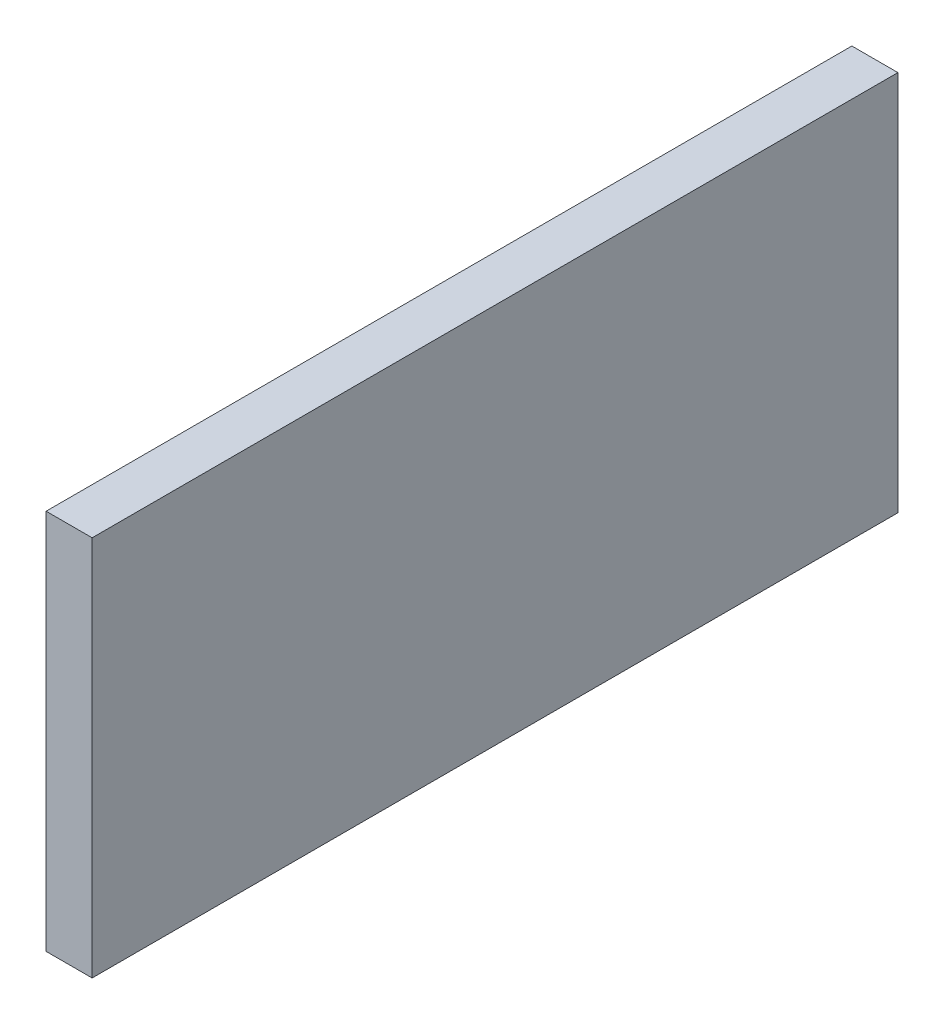
ISO-10303-21;
HEADER;
FILE_DESCRIPTION(('STEP AP214'),'2;1');
FILE_NAME('part.step','',(''),(''),'','','');
FILE_SCHEMA(('AUTOMOTIVE_DESIGN { 1 0 10303 214 1 1 1 1 }'));
ENDSEC;
DATA;
#1=APPLICATION_CONTEXT('core data for automotive mechanical design processes');
#2=APPLICATION_PROTOCOL_DEFINITION('international standard','automotive_design',2000,#1);
#3=PRODUCT_CONTEXT('',#1,'mechanical');
#4=PRODUCT('Part','Part','',(#3));
#5=PRODUCT_RELATED_PRODUCT_CATEGORY('part','',(#4));
#6=PRODUCT_DEFINITION_FORMATION('','',#4);
#7=PRODUCT_DEFINITION_CONTEXT('part definition',#1,'design');
#8=PRODUCT_DEFINITION('design','',#6,#7);
#9=PRODUCT_DEFINITION_SHAPE('','',#8);
#10=(LENGTH_UNIT() NAMED_UNIT(*) SI_UNIT(.MILLI.,.METRE.));
#11=(NAMED_UNIT(*) PLANE_ANGLE_UNIT() SI_UNIT($,.RADIAN.));
#12=(NAMED_UNIT(*) SI_UNIT($,.STERADIAN.) SOLID_ANGLE_UNIT());
#13=UNCERTAINTY_MEASURE_WITH_UNIT(LENGTH_MEASURE(1.E-05),#10,'distance_accuracy_value','');
#14=(GEOMETRIC_REPRESENTATION_CONTEXT(3) GLOBAL_UNCERTAINTY_ASSIGNED_CONTEXT((#13)) GLOBAL_UNIT_ASSIGNED_CONTEXT((#10,
#11,#12)) REPRESENTATION_CONTEXT('',''));
#15=CARTESIAN_POINT('',(0.,0.,0.));
#16=DIRECTION('',(0.,0.,1.));
#17=DIRECTION('',(1.,0.,0.));
#18=AXIS2_PLACEMENT_3D('',#15,#16,#17);
#19=CARTESIAN_POINT('',(0.,21.0312,0.));
#20=DIRECTION('',(1.,0.,0.));
#21=DIRECTION('',(0.,0.,-1.));
#22=AXIS2_PLACEMENT_3D('',#19,#20,#21);
#23=PLANE('',#22);
#24=DIRECTION('',(0.,0.,1.));
#25=VECTOR('',#24,1.);
#26=CARTESIAN_POINT('',(0.,0.,0.));
#27=LINE('',#26,#25);
#28=CARTESIAN_POINT('',(0.,0.,-44.45));
#29=VERTEX_POINT('',#28);
#30=CARTESIAN_POINT('',(0.,0.,0.));
#31=VERTEX_POINT('',#30);
#32=EDGE_CURVE('E96',#29,#31,#27,.T.);
#33=ORIENTED_EDGE('',*,*,#32,.T.);
#34=DIRECTION('',(0.,-1.,0.));
#35=VECTOR('',#34,1.);
#36=CARTESIAN_POINT('',(0.,21.0312,0.));
#37=LINE('',#36,#35);
#38=CARTESIAN_POINT('',(0.,21.0312,0.));
#39=VERTEX_POINT('',#38);
#40=EDGE_CURVE('E11',#39,#31,#37,.T.);
#41=ORIENTED_EDGE('',*,*,#40,.F.);
#42=DIRECTION('',(0.,0.,1.));
#43=VECTOR('',#42,1.);
#44=CARTESIAN_POINT('',(0.,21.0312,0.));
#45=LINE('',#44,#43);
#46=CARTESIAN_POINT('',(0.,21.0312,-44.45));
#47=VERTEX_POINT('',#46);
#48=EDGE_CURVE('E84',#47,#39,#45,.T.);
#49=ORIENTED_EDGE('',*,*,#48,.F.);
#50=DIRECTION('',(0.,-1.,0.));
#51=VECTOR('',#50,1.);
#52=CARTESIAN_POINT('',(0.,21.0312,-44.45));
#53=LINE('',#52,#51);
#54=EDGE_CURVE('E92',#47,#29,#53,.T.);
#55=ORIENTED_EDGE('',*,*,#54,.T.);
#56=EDGE_LOOP('',(#33,#41,#49,#55));
#57=FACE_BOUND('',#56,.T.);
#58=ADVANCED_FACE('F33',(#57),#23,.F.);
#59=CARTESIAN_POINT('',(0.,21.0312,0.));
#60=DIRECTION('',(0.,0.,-1.));
#61=DIRECTION('',(-1.,0.,0.));
#62=AXIS2_PLACEMENT_3D('',#59,#60,#61);
#63=PLANE('',#62);
#64=DIRECTION('',(1.,0.,0.));
#65=VECTOR('',#64,1.);
#66=CARTESIAN_POINT('',(0.,0.,0.));
#67=LINE('',#66,#65);
#68=CARTESIAN_POINT('',(2.54,0.,0.));
#69=VERTEX_POINT('',#68);
#70=EDGE_CURVE('E88',#31,#69,#67,.T.);
#71=ORIENTED_EDGE('',*,*,#70,.T.);
#72=DIRECTION('',(0.,-1.,0.));
#73=VECTOR('',#72,1.);
#74=CARTESIAN_POINT('',(2.54,21.0312,0.));
#75=LINE('',#74,#73);
#76=CARTESIAN_POINT('',(2.54,21.0312,0.));
#77=VERTEX_POINT('',#76);
#78=EDGE_CURVE('E41',#77,#69,#75,.T.);
#79=ORIENTED_EDGE('',*,*,#78,.F.);
#80=DIRECTION('',(1.,0.,0.));
#81=VECTOR('',#80,1.);
#82=CARTESIAN_POINT('',(0.,21.0312,0.));
#83=LINE('',#82,#81);
#84=EDGE_CURVE('E79',#39,#77,#83,.T.);
#85=ORIENTED_EDGE('',*,*,#84,.F.);
#86=ORIENTED_EDGE('',*,*,#40,.T.);
#87=EDGE_LOOP('',(#71,#79,#85,#86));
#88=FACE_BOUND('',#87,.T.);
#89=ADVANCED_FACE('F87',(#88),#63,.F.);
#90=CARTESIAN_POINT('',(2.54,21.0312,0.));
#91=DIRECTION('',(-1.,0.,0.));
#92=DIRECTION('',(0.,0.,1.));
#93=AXIS2_PLACEMENT_3D('',#90,#91,#92);
#94=PLANE('',#93);
#95=DIRECTION('',(0.,0.,-1.));
#96=VECTOR('',#95,1.);
#97=CARTESIAN_POINT('',(2.54,0.,0.));
#98=LINE('',#97,#96);
#99=CARTESIAN_POINT('',(2.54,0.,-44.45));
#100=VERTEX_POINT('',#99);
#101=EDGE_CURVE('E66',#69,#100,#98,.T.);
#102=ORIENTED_EDGE('',*,*,#101,.T.);
#103=DIRECTION('',(0.,-1.,0.));
#104=VECTOR('',#103,1.);
#105=CARTESIAN_POINT('',(2.54,21.0312,-44.45));
#106=LINE('',#105,#104);
#107=CARTESIAN_POINT('',(2.54,21.0312,-44.45));
#108=VERTEX_POINT('',#107);
#109=EDGE_CURVE('E89',#108,#100,#106,.T.);
#110=ORIENTED_EDGE('',*,*,#109,.F.);
#111=DIRECTION('',(0.,0.,-1.));
#112=VECTOR('',#111,1.);
#113=CARTESIAN_POINT('',(2.54,21.0312,0.));
#114=LINE('',#113,#112);
#115=EDGE_CURVE('E82',#77,#108,#114,.T.);
#116=ORIENTED_EDGE('',*,*,#115,.F.);
#117=ORIENTED_EDGE('',*,*,#78,.T.);
#118=EDGE_LOOP('',(#102,#110,#116,#117));
#119=FACE_BOUND('',#118,.T.);
#120=ADVANCED_FACE('F90',(#119),#94,.F.);
#121=CARTESIAN_POINT('',(0.,21.0312,-44.45));
#122=DIRECTION('',(0.,0.,1.));
#123=DIRECTION('',(1.,0.,0.));
#124=AXIS2_PLACEMENT_3D('',#121,#122,#123);
#125=PLANE('',#124);
#126=DIRECTION('',(-1.,0.,0.));
#127=VECTOR('',#126,1.);
#128=CARTESIAN_POINT('',(0.,0.,-44.45));
#129=LINE('',#128,#127);
#130=EDGE_CURVE('E72',#100,#29,#129,.T.);
#131=ORIENTED_EDGE('',*,*,#130,.T.);
#132=ORIENTED_EDGE('',*,*,#54,.F.);
#133=DIRECTION('',(-1.,0.,0.));
#134=VECTOR('',#133,1.);
#135=CARTESIAN_POINT('',(0.,21.0312,-44.45));
#136=LINE('',#135,#134);
#137=EDGE_CURVE('E49',#108,#47,#136,.T.);
#138=ORIENTED_EDGE('',*,*,#137,.F.);
#139=ORIENTED_EDGE('',*,*,#109,.T.);
#140=EDGE_LOOP('',(#131,#132,#138,#139));
#141=FACE_BOUND('',#140,.T.);
#142=ADVANCED_FACE('F103',(#141),#125,.F.);
#143=CARTESIAN_POINT('',(0.,21.0312,0.));
#144=DIRECTION('',(0.,-1.,0.));
#145=DIRECTION('',(0.,0.,-1.));
#146=AXIS2_PLACEMENT_3D('',#143,#144,#145);
#147=PLANE('',#146);
#148=ORIENTED_EDGE('',*,*,#48,.T.);
#149=ORIENTED_EDGE('',*,*,#84,.T.);
#150=ORIENTED_EDGE('',*,*,#115,.T.);
#151=ORIENTED_EDGE('',*,*,#137,.T.);
#152=EDGE_LOOP('',(#148,#149,#150,#151));
#153=FACE_BOUND('',#152,.T.);
#154=ADVANCED_FACE('F80',(#153),#147,.F.);
#155=CARTESIAN_POINT('',(0.,0.,0.));
#156=DIRECTION('',(0.,-1.,0.));
#157=DIRECTION('',(0.,0.,-1.));
#158=AXIS2_PLACEMENT_3D('',#155,#156,#157);
#159=PLANE('',#158);
#160=ORIENTED_EDGE('',*,*,#32,.F.);
#161=ORIENTED_EDGE('',*,*,#130,.F.);
#162=ORIENTED_EDGE('',*,*,#101,.F.);
#163=ORIENTED_EDGE('',*,*,#70,.F.);
#164=EDGE_LOOP('',(#160,#161,#162,#163));
#165=FACE_BOUND('',#164,.T.);
#166=ADVANCED_FACE('F106',(#165),#159,.T.);
#167=CLOSED_SHELL('',(#58,#89,#120,#142,#154,#166));
#168=MANIFOLD_SOLID_BREP('B2',#167);
#169=ADVANCED_BREP_SHAPE_REPRESENTATION('',(#18,#168),#14);
#170=SHAPE_DEFINITION_REPRESENTATION(#9,#169);
ENDSEC;
END-ISO-10303-21;
